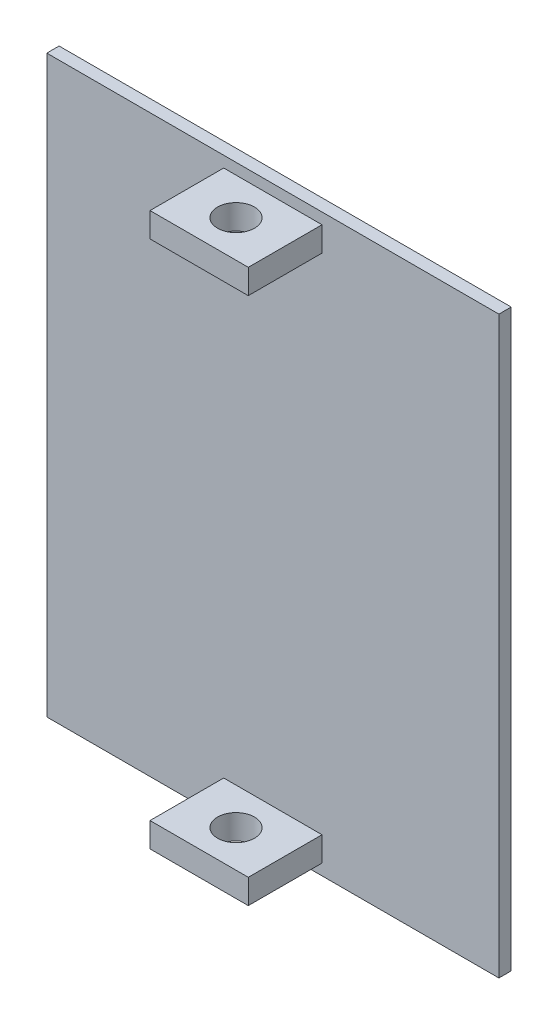
ISO-10303-21;
HEADER;
FILE_DESCRIPTION(('STEP AP214'),'2;1');
FILE_NAME('part.step','',(''),(''),'','','');
FILE_SCHEMA(('AUTOMOTIVE_DESIGN { 1 0 10303 214 1 1 1 1 }'));
ENDSEC;
DATA;
#1=APPLICATION_CONTEXT('core data for automotive mechanical design processes');
#2=APPLICATION_PROTOCOL_DEFINITION('international standard','automotive_design',2000,#1);
#3=PRODUCT_CONTEXT('',#1,'mechanical');
#4=PRODUCT('Part','Part','',(#3));
#5=PRODUCT_RELATED_PRODUCT_CATEGORY('part','',(#4));
#6=PRODUCT_DEFINITION_FORMATION('','',#4);
#7=PRODUCT_DEFINITION_CONTEXT('part definition',#1,'design');
#8=PRODUCT_DEFINITION('design','',#6,#7);
#9=PRODUCT_DEFINITION_SHAPE('','',#8);
#10=(LENGTH_UNIT() NAMED_UNIT(*) SI_UNIT(.MILLI.,.METRE.));
#11=(NAMED_UNIT(*) PLANE_ANGLE_UNIT() SI_UNIT($,.RADIAN.));
#12=(NAMED_UNIT(*) SI_UNIT($,.STERADIAN.) SOLID_ANGLE_UNIT());
#13=UNCERTAINTY_MEASURE_WITH_UNIT(LENGTH_MEASURE(1.E-05),#10,'distance_accuracy_value','');
#14=(GEOMETRIC_REPRESENTATION_CONTEXT(3) GLOBAL_UNCERTAINTY_ASSIGNED_CONTEXT((#13)) GLOBAL_UNIT_ASSIGNED_CONTEXT((#10,
#11,#12)) REPRESENTATION_CONTEXT('',''));
#15=CARTESIAN_POINT('',(0.,0.,0.));
#16=DIRECTION('',(0.,0.,1.));
#17=DIRECTION('',(1.,0.,0.));
#18=AXIS2_PLACEMENT_3D('',#15,#16,#17);
#19=CARTESIAN_POINT('',(0.,0.,1.));
#20=DIRECTION('',(0.,0.,-1.));
#21=DIRECTION('',(-1.,0.,0.));
#22=AXIS2_PLACEMENT_3D('',#19,#20,#21);
#23=PLANE('',#22);
#24=DIRECTION('',(0.,-1.,0.));
#25=VECTOR('',#24,1.);
#26=CARTESIAN_POINT('',(-3.99999999999999,0.,1.));
#27=LINE('',#26,#25);
#28=CARTESIAN_POINT('',(-3.99999999999999,-20.5,1.));
#29=VERTEX_POINT('',#28);
#30=CARTESIAN_POINT('',(-3.99999999999999,-22.5,1.));
#31=VERTEX_POINT('',#30);
#32=EDGE_CURVE('E161',#29,#31,#27,.T.);
#33=ORIENTED_EDGE('',*,*,#32,.F.);
#34=DIRECTION('',(1.,0.,0.));
#35=VECTOR('',#34,1.);
#36=CARTESIAN_POINT('',(0.,-20.5,1.));
#37=LINE('',#36,#35);
#38=CARTESIAN_POINT('',(4.,-20.5,1.));
#39=VERTEX_POINT('',#38);
#40=EDGE_CURVE('E163',#29,#39,#37,.T.);
#41=ORIENTED_EDGE('',*,*,#40,.T.);
#42=DIRECTION('',(0.,-1.,0.));
#43=VECTOR('',#42,1.);
#44=CARTESIAN_POINT('',(4.,0.,1.));
#45=LINE('',#44,#43);
#46=CARTESIAN_POINT('',(4.,-22.5,1.));
#47=VERTEX_POINT('',#46);
#48=EDGE_CURVE('E127',#39,#47,#45,.T.);
#49=ORIENTED_EDGE('',*,*,#48,.T.);
#50=DIRECTION('',(1.,0.,0.));
#51=VECTOR('',#50,1.);
#52=CARTESIAN_POINT('',(0.,-22.5,1.));
#53=LINE('',#52,#51);
#54=EDGE_CURVE('E159',#31,#47,#53,.T.);
#55=ORIENTED_EDGE('',*,*,#54,.F.);
#56=EDGE_LOOP('',(#33,#41,#49,#55));
#57=FACE_BOUND('',#56,.T.);
#58=DIRECTION('',(0.,1.,0.));
#59=VECTOR('',#58,1.);
#60=CARTESIAN_POINT('',(18.4,-23.4,1.));
#61=LINE('',#60,#59);
#62=CARTESIAN_POINT('',(18.4,-23.4,1.));
#63=VERTEX_POINT('',#62);
#64=CARTESIAN_POINT('',(18.4,23.4,1.));
#65=VERTEX_POINT('',#64);
#66=EDGE_CURVE('E196',#63,#65,#61,.T.);
#67=ORIENTED_EDGE('',*,*,#66,.T.);
#68=DIRECTION('',(-1.,0.,0.));
#69=VECTOR('',#68,1.);
#70=CARTESIAN_POINT('',(-18.4,23.4,1.));
#71=LINE('',#70,#69);
#72=CARTESIAN_POINT('',(-18.4,23.4,1.));
#73=VERTEX_POINT('',#72);
#74=EDGE_CURVE('E199',#65,#73,#71,.T.);
#75=ORIENTED_EDGE('',*,*,#74,.T.);
#76=DIRECTION('',(0.,-1.,0.));
#77=VECTOR('',#76,1.);
#78=CARTESIAN_POINT('',(-18.4,-23.4,1.));
#79=LINE('',#78,#77);
#80=CARTESIAN_POINT('',(-18.4,-23.4,1.));
#81=VERTEX_POINT('',#80);
#82=EDGE_CURVE('E202',#73,#81,#79,.T.);
#83=ORIENTED_EDGE('',*,*,#82,.T.);
#84=DIRECTION('',(1.,0.,0.));
#85=VECTOR('',#84,1.);
#86=CARTESIAN_POINT('',(-18.4,-23.4,1.));
#87=LINE('',#86,#85);
#88=EDGE_CURVE('E204',#81,#63,#87,.T.);
#89=ORIENTED_EDGE('',*,*,#88,.T.);
#90=EDGE_LOOP('',(#67,#75,#83,#89));
#91=FACE_BOUND('',#90,.T.);
#92=DIRECTION('',(1.,0.,0.));
#93=VECTOR('',#92,1.);
#94=CARTESIAN_POINT('',(0.,20.5,1.));
#95=LINE('',#94,#93);
#96=CARTESIAN_POINT('',(-4.,20.5,1.));
#97=VERTEX_POINT('',#96);
#98=CARTESIAN_POINT('',(4.,20.5,1.));
#99=VERTEX_POINT('',#98);
#100=EDGE_CURVE('E193',#97,#99,#95,.T.);
#101=ORIENTED_EDGE('',*,*,#100,.F.);
#102=DIRECTION('',(0.,1.,0.));
#103=VECTOR('',#102,1.);
#104=CARTESIAN_POINT('',(-4.,0.,1.));
#105=LINE('',#104,#103);
#106=CARTESIAN_POINT('',(-4.,22.5,1.));
#107=VERTEX_POINT('',#106);
#108=EDGE_CURVE('E185',#97,#107,#105,.T.);
#109=ORIENTED_EDGE('',*,*,#108,.T.);
#110=DIRECTION('',(1.,0.,0.));
#111=VECTOR('',#110,1.);
#112=CARTESIAN_POINT('',(0.,22.5,1.));
#113=LINE('',#112,#111);
#114=CARTESIAN_POINT('',(4.,22.5,1.));
#115=VERTEX_POINT('',#114);
#116=EDGE_CURVE('E188',#107,#115,#113,.T.);
#117=ORIENTED_EDGE('',*,*,#116,.T.);
#118=DIRECTION('',(0.,1.,0.));
#119=VECTOR('',#118,1.);
#120=CARTESIAN_POINT('',(4.,0.,1.));
#121=LINE('',#120,#119);
#122=EDGE_CURVE('E191',#99,#115,#121,.T.);
#123=ORIENTED_EDGE('',*,*,#122,.F.);
#124=EDGE_LOOP('',(#101,#109,#117,#123));
#125=FACE_BOUND('',#124,.T.);
#126=ADVANCED_FACE('F33',(#57,#91,#125),#23,.F.);
#127=CARTESIAN_POINT('',(18.4,-23.4,1.));
#128=DIRECTION('',(-1.,0.,0.));
#129=DIRECTION('',(0.,0.,1.));
#130=AXIS2_PLACEMENT_3D('',#127,#128,#129);
#131=PLANE('',#130);
#132=DIRECTION('',(0.,1.,0.));
#133=VECTOR('',#132,1.);
#134=CARTESIAN_POINT('',(18.4,-23.4,0.));
#135=LINE('',#134,#133);
#136=CARTESIAN_POINT('',(18.4,-23.4,0.));
#137=VERTEX_POINT('',#136);
#138=CARTESIAN_POINT('',(18.4,23.4,0.));
#139=VERTEX_POINT('',#138);
#140=EDGE_CURVE('E195',#137,#139,#135,.T.);
#141=ORIENTED_EDGE('',*,*,#140,.T.);
#142=DIRECTION('',(0.,0.,-1.));
#143=VECTOR('',#142,1.);
#144=CARTESIAN_POINT('',(18.4,23.4,1.));
#145=LINE('',#144,#143);
#146=EDGE_CURVE('E11',#65,#139,#145,.T.);
#147=ORIENTED_EDGE('',*,*,#146,.F.);
#148=ORIENTED_EDGE('',*,*,#66,.F.);
#149=DIRECTION('',(0.,0.,-1.));
#150=VECTOR('',#149,1.);
#151=CARTESIAN_POINT('',(18.4,-23.4,1.));
#152=LINE('',#151,#150);
#153=EDGE_CURVE('E206',#63,#137,#152,.T.);
#154=ORIENTED_EDGE('',*,*,#153,.T.);
#155=EDGE_LOOP('',(#141,#147,#148,#154));
#156=FACE_BOUND('',#155,.T.);
#157=ADVANCED_FACE('F35',(#156),#131,.F.);
#158=CARTESIAN_POINT('',(-18.4,23.4,1.));
#159=DIRECTION('',(0.,-1.,0.));
#160=DIRECTION('',(0.,0.,-1.));
#161=AXIS2_PLACEMENT_3D('',#158,#159,#160);
#162=PLANE('',#161);
#163=DIRECTION('',(-1.,0.,0.));
#164=VECTOR('',#163,1.);
#165=CARTESIAN_POINT('',(-18.4,23.4,0.));
#166=LINE('',#165,#164);
#167=CARTESIAN_POINT('',(-18.4,23.4,0.));
#168=VERTEX_POINT('',#167);
#169=EDGE_CURVE('E209',#139,#168,#166,.T.);
#170=ORIENTED_EDGE('',*,*,#169,.T.);
#171=DIRECTION('',(0.,0.,-1.));
#172=VECTOR('',#171,1.);
#173=CARTESIAN_POINT('',(-18.4,23.4,1.));
#174=LINE('',#173,#172);
#175=EDGE_CURVE('E42',#73,#168,#174,.T.);
#176=ORIENTED_EDGE('',*,*,#175,.F.);
#177=ORIENTED_EDGE('',*,*,#74,.F.);
#178=ORIENTED_EDGE('',*,*,#146,.T.);
#179=EDGE_LOOP('',(#170,#176,#177,#178));
#180=FACE_BOUND('',#179,.T.);
#181=ADVANCED_FACE('F240',(#180),#162,.F.);
#182=CARTESIAN_POINT('',(-18.4,-23.4,1.));
#183=DIRECTION('',(1.,0.,0.));
#184=DIRECTION('',(0.,0.,-1.));
#185=AXIS2_PLACEMENT_3D('',#182,#183,#184);
#186=PLANE('',#185);
#187=DIRECTION('',(0.,-1.,0.));
#188=VECTOR('',#187,1.);
#189=CARTESIAN_POINT('',(-18.4,-23.4,0.));
#190=LINE('',#189,#188);
#191=CARTESIAN_POINT('',(-18.4,-23.4,0.));
#192=VERTEX_POINT('',#191);
#193=EDGE_CURVE('E211',#168,#192,#190,.T.);
#194=ORIENTED_EDGE('',*,*,#193,.T.);
#195=DIRECTION('',(0.,0.,-1.));
#196=VECTOR('',#195,1.);
#197=CARTESIAN_POINT('',(-18.4,-23.4,1.));
#198=LINE('',#197,#196);
#199=EDGE_CURVE('E216',#81,#192,#198,.T.);
#200=ORIENTED_EDGE('',*,*,#199,.F.);
#201=ORIENTED_EDGE('',*,*,#82,.F.);
#202=ORIENTED_EDGE('',*,*,#175,.T.);
#203=EDGE_LOOP('',(#194,#200,#201,#202));
#204=FACE_BOUND('',#203,.T.);
#205=ADVANCED_FACE('F224',(#204),#186,.F.);
#206=CARTESIAN_POINT('',(-18.4,-23.4,1.));
#207=DIRECTION('',(0.,1.,0.));
#208=DIRECTION('',(0.,0.,1.));
#209=AXIS2_PLACEMENT_3D('',#206,#207,#208);
#210=PLANE('',#209);
#211=DIRECTION('',(1.,0.,0.));
#212=VECTOR('',#211,1.);
#213=CARTESIAN_POINT('',(-18.4,-23.4,0.));
#214=LINE('',#213,#212);
#215=EDGE_CURVE('E200',#192,#137,#214,.T.);
#216=ORIENTED_EDGE('',*,*,#215,.T.);
#217=ORIENTED_EDGE('',*,*,#153,.F.);
#218=ORIENTED_EDGE('',*,*,#88,.F.);
#219=ORIENTED_EDGE('',*,*,#199,.T.);
#220=EDGE_LOOP('',(#216,#217,#218,#219));
#221=FACE_BOUND('',#220,.T.);
#222=ADVANCED_FACE('F233',(#221),#210,.F.);
#223=CARTESIAN_POINT('',(0.,0.,0.));
#224=DIRECTION('',(0.,0.,-1.));
#225=DIRECTION('',(-1.,0.,0.));
#226=AXIS2_PLACEMENT_3D('',#223,#224,#225);
#227=PLANE('',#226);
#228=ORIENTED_EDGE('',*,*,#140,.F.);
#229=ORIENTED_EDGE('',*,*,#215,.F.);
#230=ORIENTED_EDGE('',*,*,#193,.F.);
#231=ORIENTED_EDGE('',*,*,#169,.F.);
#232=EDGE_LOOP('',(#228,#229,#230,#231));
#233=FACE_BOUND('',#232,.T.);
#234=ADVANCED_FACE('F230',(#233),#227,.T.);
#235=CARTESIAN_POINT('',(-4.,20.5,7.));
#236=DIRECTION('',(0.,1.,0.));
#237=DIRECTION('',(0.,0.,1.));
#238=AXIS2_PLACEMENT_3D('',#235,#236,#237);
#239=PLANE('',#238);
#240=CARTESIAN_POINT('',(0.,20.5,4.));
#241=DIRECTION('',(0.,1.,0.));
#242=DIRECTION('',(0.,0.,1.));
#243=AXIS2_PLACEMENT_3D('',#240,#241,#242);
#244=CIRCLE('',#243,1.5);
#245=CARTESIAN_POINT('',(0.,20.5,5.5));
#246=VERTEX_POINT('',#245);
#247=EDGE_CURVE('E144',#246,#246,#244,.T.);
#248=ORIENTED_EDGE('',*,*,#247,.T.);
#249=EDGE_LOOP('',(#248));
#250=FACE_BOUND('',#249,.T.);
#251=DIRECTION('',(0.,0.,-1.));
#252=VECTOR('',#251,1.);
#253=CARTESIAN_POINT('',(-4.,20.5,7.));
#254=LINE('',#253,#252);
#255=CARTESIAN_POINT('',(-4.,20.5,7.));
#256=VERTEX_POINT('',#255);
#257=EDGE_CURVE('E175',#256,#97,#254,.T.);
#258=ORIENTED_EDGE('',*,*,#257,.T.);
#259=ORIENTED_EDGE('',*,*,#100,.T.);
#260=DIRECTION('',(0.,0.,-1.));
#261=VECTOR('',#260,1.);
#262=CARTESIAN_POINT('',(4.,20.5,7.));
#263=LINE('',#262,#261);
#264=CARTESIAN_POINT('',(4.,20.5,7.));
#265=VERTEX_POINT('',#264);
#266=EDGE_CURVE('E182',#265,#99,#263,.T.);
#267=ORIENTED_EDGE('',*,*,#266,.F.);
#268=DIRECTION('',(1.,0.,0.));
#269=VECTOR('',#268,1.);
#270=CARTESIAN_POINT('',(-4.,20.5,7.));
#271=LINE('',#270,#269);
#272=EDGE_CURVE('E165',#256,#265,#271,.T.);
#273=ORIENTED_EDGE('',*,*,#272,.F.);
#274=EDGE_LOOP('',(#258,#259,#267,#273));
#275=FACE_BOUND('',#274,.T.);
#276=ADVANCED_FACE('F257',(#250,#275),#239,.F.);
#277=CARTESIAN_POINT('',(4.,20.5,7.));
#278=DIRECTION('',(-1.,0.,0.));
#279=DIRECTION('',(0.,0.,1.));
#280=AXIS2_PLACEMENT_3D('',#277,#278,#279);
#281=PLANE('',#280);
#282=ORIENTED_EDGE('',*,*,#266,.T.);
#283=ORIENTED_EDGE('',*,*,#122,.T.);
#284=DIRECTION('',(0.,0.,-1.));
#285=VECTOR('',#284,1.);
#286=CARTESIAN_POINT('',(4.,22.5,7.));
#287=LINE('',#286,#285);
#288=CARTESIAN_POINT('',(4.,22.5,7.));
#289=VERTEX_POINT('',#288);
#290=EDGE_CURVE('E179',#289,#115,#287,.T.);
#291=ORIENTED_EDGE('',*,*,#290,.F.);
#292=DIRECTION('',(0.,1.,0.));
#293=VECTOR('',#292,1.);
#294=CARTESIAN_POINT('',(4.,20.5,7.));
#295=LINE('',#294,#293);
#296=EDGE_CURVE('E168',#265,#289,#295,.T.);
#297=ORIENTED_EDGE('',*,*,#296,.F.);
#298=EDGE_LOOP('',(#282,#283,#291,#297));
#299=FACE_BOUND('',#298,.T.);
#300=ADVANCED_FACE('F284',(#299),#281,.F.);
#301=CARTESIAN_POINT('',(-4.,22.5,7.));
#302=DIRECTION('',(0.,1.,0.));
#303=DIRECTION('',(0.,0.,1.));
#304=AXIS2_PLACEMENT_3D('',#301,#302,#303);
#305=PLANE('',#304);
#306=CARTESIAN_POINT('',(0.,22.5,4.));
#307=DIRECTION('',(0.,1.,0.));
#308=DIRECTION('',(0.,0.,1.));
#309=AXIS2_PLACEMENT_3D('',#306,#307,#308);
#310=CIRCLE('',#309,1.5);
#311=CARTESIAN_POINT('',(0.,22.5,5.5));
#312=VERTEX_POINT('',#311);
#313=EDGE_CURVE('E389',#312,#312,#310,.T.);
#314=ORIENTED_EDGE('',*,*,#313,.F.);
#315=EDGE_LOOP('',(#314));
#316=FACE_BOUND('',#315,.T.);
#317=ORIENTED_EDGE('',*,*,#116,.F.);
#318=DIRECTION('',(0.,0.,-1.));
#319=VECTOR('',#318,1.);
#320=CARTESIAN_POINT('',(-4.,22.5,7.));
#321=LINE('',#320,#319);
#322=CARTESIAN_POINT('',(-4.,22.5,7.));
#323=VERTEX_POINT('',#322);
#324=EDGE_CURVE('E57',#323,#107,#321,.T.);
#325=ORIENTED_EDGE('',*,*,#324,.F.);
#326=DIRECTION('',(1.,0.,0.));
#327=VECTOR('',#326,1.);
#328=CARTESIAN_POINT('',(-4.,22.5,7.));
#329=LINE('',#328,#327);
#330=EDGE_CURVE('E170',#323,#289,#329,.T.);
#331=ORIENTED_EDGE('',*,*,#330,.T.);
#332=ORIENTED_EDGE('',*,*,#290,.T.);
#333=EDGE_LOOP('',(#317,#325,#331,#332));
#334=FACE_BOUND('',#333,.T.);
#335=ADVANCED_FACE('F291',(#316,#334),#305,.T.);
#336=CARTESIAN_POINT('',(-4.,20.5,7.));
#337=DIRECTION('',(-1.,0.,0.));
#338=DIRECTION('',(0.,0.,1.));
#339=AXIS2_PLACEMENT_3D('',#336,#337,#338);
#340=PLANE('',#339);
#341=ORIENTED_EDGE('',*,*,#108,.F.);
#342=ORIENTED_EDGE('',*,*,#257,.F.);
#343=DIRECTION('',(0.,1.,0.));
#344=VECTOR('',#343,1.);
#345=CARTESIAN_POINT('',(-4.,20.5,7.));
#346=LINE('',#345,#344);
#347=EDGE_CURVE('E173',#256,#323,#346,.T.);
#348=ORIENTED_EDGE('',*,*,#347,.T.);
#349=ORIENTED_EDGE('',*,*,#324,.T.);
#350=EDGE_LOOP('',(#341,#342,#348,#349));
#351=FACE_BOUND('',#350,.T.);
#352=ADVANCED_FACE('F298',(#351),#340,.T.);
#353=CARTESIAN_POINT('',(0.,0.,7.));
#354=DIRECTION('',(0.,0.,1.));
#355=DIRECTION('',(1.,0.,0.));
#356=AXIS2_PLACEMENT_3D('',#353,#354,#355);
#357=PLANE('',#356);
#358=ORIENTED_EDGE('',*,*,#272,.T.);
#359=ORIENTED_EDGE('',*,*,#296,.T.);
#360=ORIENTED_EDGE('',*,*,#330,.F.);
#361=ORIENTED_EDGE('',*,*,#347,.F.);
#362=EDGE_LOOP('',(#358,#359,#360,#361));
#363=FACE_BOUND('',#362,.T.);
#364=ADVANCED_FACE('F306',(#363),#357,.T.);
#365=CARTESIAN_POINT('',(-3.99999999999999,-20.5,7.));
#366=DIRECTION('',(0.,1.,0.));
#367=DIRECTION('',(0.,0.,1.));
#368=AXIS2_PLACEMENT_3D('',#365,#366,#367);
#369=PLANE('',#368);
#370=CARTESIAN_POINT('',(0.,-20.5,4.));
#371=DIRECTION('',(0.,1.,0.));
#372=DIRECTION('',(0.,0.,1.));
#373=AXIS2_PLACEMENT_3D('',#370,#371,#372);
#374=CIRCLE('',#373,1.5);
#375=CARTESIAN_POINT('',(0.,-20.5,5.5));
#376=VERTEX_POINT('',#375);
#377=EDGE_CURVE('E147',#376,#376,#374,.T.);
#378=ORIENTED_EDGE('',*,*,#377,.F.);
#379=EDGE_LOOP('',(#378));
#380=FACE_BOUND('',#379,.T.);
#381=ORIENTED_EDGE('',*,*,#40,.F.);
#382=DIRECTION('',(0.,0.,-1.));
#383=VECTOR('',#382,1.);
#384=CARTESIAN_POINT('',(-3.99999999999999,-20.5,7.));
#385=LINE('',#384,#383);
#386=CARTESIAN_POINT('',(-3.99999999999999,-20.5,7.));
#387=VERTEX_POINT('',#386);
#388=EDGE_CURVE('E142',#387,#29,#385,.T.);
#389=ORIENTED_EDGE('',*,*,#388,.F.);
#390=DIRECTION('',(1.,0.,0.));
#391=VECTOR('',#390,1.);
#392=CARTESIAN_POINT('',(-3.99999999999999,-20.5,7.));
#393=LINE('',#392,#391);
#394=CARTESIAN_POINT('',(4.,-20.5,7.));
#395=VERTEX_POINT('',#394);
#396=EDGE_CURVE('E136',#387,#395,#393,.T.);
#397=ORIENTED_EDGE('',*,*,#396,.T.);
#398=DIRECTION('',(0.,0.,-1.));
#399=VECTOR('',#398,1.);
#400=CARTESIAN_POINT('',(4.,-20.5,7.));
#401=LINE('',#400,#399);
#402=EDGE_CURVE('E122',#395,#39,#401,.T.);
#403=ORIENTED_EDGE('',*,*,#402,.T.);
#404=EDGE_LOOP('',(#381,#389,#397,#403));
#405=FACE_BOUND('',#404,.T.);
#406=ADVANCED_FACE('F140',(#380,#405),#369,.T.);
#407=CARTESIAN_POINT('',(-3.99999999999999,-20.5,7.));
#408=DIRECTION('',(1.,0.,0.));
#409=DIRECTION('',(0.,0.,-1.));
#410=AXIS2_PLACEMENT_3D('',#407,#408,#409);
#411=PLANE('',#410);
#412=ORIENTED_EDGE('',*,*,#388,.T.);
#413=ORIENTED_EDGE('',*,*,#32,.T.);
#414=DIRECTION('',(0.,0.,-1.));
#415=VECTOR('',#414,1.);
#416=CARTESIAN_POINT('',(-3.99999999999999,-22.5,7.));
#417=LINE('',#416,#415);
#418=CARTESIAN_POINT('',(-3.99999999999999,-22.5,7.));
#419=VERTEX_POINT('',#418);
#420=EDGE_CURVE('E154',#419,#31,#417,.T.);
#421=ORIENTED_EDGE('',*,*,#420,.F.);
#422=DIRECTION('',(0.,-1.,0.));
#423=VECTOR('',#422,1.);
#424=CARTESIAN_POINT('',(-3.99999999999999,-20.5,7.));
#425=LINE('',#424,#423);
#426=EDGE_CURVE('E131',#387,#419,#425,.T.);
#427=ORIENTED_EDGE('',*,*,#426,.F.);
#428=EDGE_LOOP('',(#412,#413,#421,#427));
#429=FACE_BOUND('',#428,.T.);
#430=ADVANCED_FACE('F318',(#429),#411,.F.);
#431=CARTESIAN_POINT('',(-3.99999999999999,-22.5,7.));
#432=DIRECTION('',(0.,1.,0.));
#433=DIRECTION('',(0.,0.,1.));
#434=AXIS2_PLACEMENT_3D('',#431,#432,#433);
#435=PLANE('',#434);
#436=CARTESIAN_POINT('',(0.,-22.5,4.));
#437=DIRECTION('',(0.,1.,0.));
#438=DIRECTION('',(0.,0.,1.));
#439=AXIS2_PLACEMENT_3D('',#436,#437,#438);
#440=CIRCLE('',#439,1.5);
#441=CARTESIAN_POINT('',(0.,-22.5,5.5));
#442=VERTEX_POINT('',#441);
#443=EDGE_CURVE('E37',#442,#442,#440,.T.);
#444=ORIENTED_EDGE('',*,*,#443,.T.);
#445=EDGE_LOOP('',(#444));
#446=FACE_BOUND('',#445,.T.);
#447=ORIENTED_EDGE('',*,*,#420,.T.);
#448=ORIENTED_EDGE('',*,*,#54,.T.);
#449=DIRECTION('',(0.,0.,-1.));
#450=VECTOR('',#449,1.);
#451=CARTESIAN_POINT('',(4.,-22.5,7.));
#452=LINE('',#451,#450);
#453=CARTESIAN_POINT('',(4.,-22.5,7.));
#454=VERTEX_POINT('',#453);
#455=EDGE_CURVE('E49',#454,#47,#452,.T.);
#456=ORIENTED_EDGE('',*,*,#455,.F.);
#457=DIRECTION('',(1.,0.,0.));
#458=VECTOR('',#457,1.);
#459=CARTESIAN_POINT('',(-3.99999999999999,-22.5,7.));
#460=LINE('',#459,#458);
#461=EDGE_CURVE('E138',#419,#454,#460,.T.);
#462=ORIENTED_EDGE('',*,*,#461,.F.);
#463=EDGE_LOOP('',(#447,#448,#456,#462));
#464=FACE_BOUND('',#463,.T.);
#465=ADVANCED_FACE('F326',(#446,#464),#435,.F.);
#466=CARTESIAN_POINT('',(4.,-20.5,7.));
#467=DIRECTION('',(1.,0.,0.));
#468=DIRECTION('',(0.,0.,-1.));
#469=AXIS2_PLACEMENT_3D('',#466,#467,#468);
#470=PLANE('',#469);
#471=ORIENTED_EDGE('',*,*,#48,.F.);
#472=ORIENTED_EDGE('',*,*,#402,.F.);
#473=DIRECTION('',(0.,-1.,0.));
#474=VECTOR('',#473,1.);
#475=CARTESIAN_POINT('',(4.,-20.5,7.));
#476=LINE('',#475,#474);
#477=EDGE_CURVE('E125',#395,#454,#476,.T.);
#478=ORIENTED_EDGE('',*,*,#477,.T.);
#479=ORIENTED_EDGE('',*,*,#455,.T.);
#480=EDGE_LOOP('',(#471,#472,#478,#479));
#481=FACE_BOUND('',#480,.T.);
#482=ADVANCED_FACE('F124',(#481),#470,.T.);
#483=CARTESIAN_POINT('',(0.,0.,7.));
#484=DIRECTION('',(0.,0.,-1.));
#485=DIRECTION('',(-1.,0.,0.));
#486=AXIS2_PLACEMENT_3D('',#483,#484,#485);
#487=PLANE('',#486);
#488=ORIENTED_EDGE('',*,*,#396,.F.);
#489=ORIENTED_EDGE('',*,*,#426,.T.);
#490=ORIENTED_EDGE('',*,*,#461,.T.);
#491=ORIENTED_EDGE('',*,*,#477,.F.);
#492=EDGE_LOOP('',(#488,#489,#490,#491));
#493=FACE_BOUND('',#492,.T.);
#494=ADVANCED_FACE('F135',(#493),#487,.F.);
#495=CARTESIAN_POINT('',(0.,-23.4,4.));
#496=DIRECTION('',(0.,1.,0.));
#497=DIRECTION('',(0.,0.,1.));
#498=AXIS2_PLACEMENT_3D('',#495,#496,#497);
#499=CYLINDRICAL_SURFACE('',#498,1.5);
#500=ORIENTED_EDGE('',*,*,#377,.T.);
#501=EDGE_LOOP('',(#500));
#502=FACE_BOUND('',#501,.T.);
#503=ORIENTED_EDGE('',*,*,#443,.F.);
#504=EDGE_LOOP('',(#503));
#505=FACE_BOUND('',#504,.T.);
#506=ADVANCED_FACE('F346',(#502,#505),#499,.F.);
#507=ORIENTED_EDGE('',*,*,#313,.T.);
#508=EDGE_LOOP('',(#507));
#509=FACE_BOUND('',#508,.T.);
#510=ORIENTED_EDGE('',*,*,#247,.F.);
#511=EDGE_LOOP('',(#510));
#512=FACE_BOUND('',#511,.T.);
#513=ADVANCED_FACE('F352',(#509,#512),#499,.F.);
#514=CLOSED_SHELL('',(#126,#157,#181,#205,#222,#234,#276,#300,#335,#352,#364,#406,#430,#465,
#482,#494,#506,#513));
#515=MANIFOLD_SOLID_BREP('B2',#514);
#516=ADVANCED_BREP_SHAPE_REPRESENTATION('',(#18,#515),#14);
#517=SHAPE_DEFINITION_REPRESENTATION(#9,#516);
ENDSEC;
END-ISO-10303-21;
